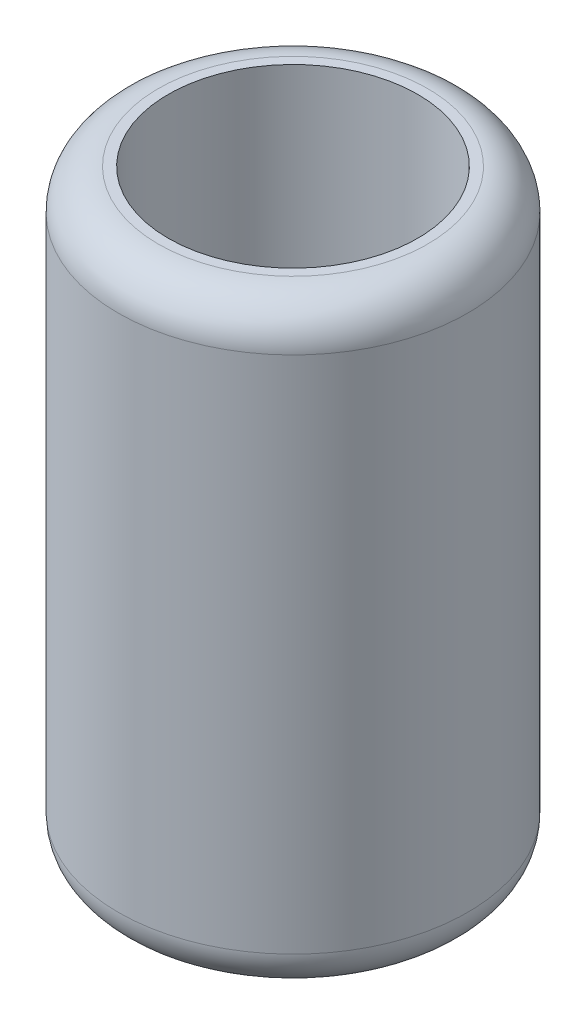
ISO-10303-21;
HEADER;
FILE_DESCRIPTION(('STEP AP214'),'2;1');
FILE_NAME('part.step','',(''),(''),'','','');
FILE_SCHEMA(('AUTOMOTIVE_DESIGN { 1 0 10303 214 1 1 1 1 }'));
ENDSEC;
DATA;
#1=APPLICATION_CONTEXT('core data for automotive mechanical design processes');
#2=APPLICATION_PROTOCOL_DEFINITION('international standard','automotive_design',2000,#1);
#3=PRODUCT_CONTEXT('',#1,'mechanical');
#4=PRODUCT('Part','Part','',(#3));
#5=PRODUCT_RELATED_PRODUCT_CATEGORY('part','',(#4));
#6=PRODUCT_DEFINITION_FORMATION('','',#4);
#7=PRODUCT_DEFINITION_CONTEXT('part definition',#1,'design');
#8=PRODUCT_DEFINITION('design','',#6,#7);
#9=PRODUCT_DEFINITION_SHAPE('','',#8);
#10=(LENGTH_UNIT() NAMED_UNIT(*) SI_UNIT(.MILLI.,.METRE.));
#11=(NAMED_UNIT(*) PLANE_ANGLE_UNIT() SI_UNIT($,.RADIAN.));
#12=(NAMED_UNIT(*) SI_UNIT($,.STERADIAN.) SOLID_ANGLE_UNIT());
#13=UNCERTAINTY_MEASURE_WITH_UNIT(LENGTH_MEASURE(1.E-05),#10,'distance_accuracy_value','');
#14=(GEOMETRIC_REPRESENTATION_CONTEXT(3) GLOBAL_UNCERTAINTY_ASSIGNED_CONTEXT((#13)) GLOBAL_UNIT_ASSIGNED_CONTEXT((#10,
#11,#12)) REPRESENTATION_CONTEXT('',''));
#15=CARTESIAN_POINT('',(0.,0.,0.));
#16=DIRECTION('',(0.,0.,1.));
#17=DIRECTION('',(1.,0.,0.));
#18=AXIS2_PLACEMENT_3D('',#15,#16,#17);
#19=CARTESIAN_POINT('',(0.,38.1,0.));
#20=DIRECTION('',(0.,-1.,0.));
#21=DIRECTION('',(0.,0.,-1.));
#22=AXIS2_PLACEMENT_3D('',#19,#20,#21);
#23=CYLINDRICAL_SURFACE('',#22,11.1125);
#24=CARTESIAN_POINT('',(0.,2.53999999999999,0.));
#25=DIRECTION('',(0.,1.,0.));
#26=DIRECTION('',(0.,0.,1.));
#27=AXIS2_PLACEMENT_3D('',#24,#25,#26);
#28=CIRCLE('',#27,11.1125);
#29=CARTESIAN_POINT('',(0.,2.53999999999999,11.1125));
#30=VERTEX_POINT('',#29);
#31=EDGE_CURVE('E46',#30,#30,#28,.T.);
#32=ORIENTED_EDGE('',*,*,#31,.T.);
#33=EDGE_LOOP('',(#32));
#34=FACE_BOUND('',#33,.T.);
#35=CARTESIAN_POINT('',(0.,35.56,0.));
#36=DIRECTION('',(0.,1.,0.));
#37=DIRECTION('',(0.,0.,1.));
#38=AXIS2_PLACEMENT_3D('',#35,#36,#37);
#39=CIRCLE('',#38,11.1125);
#40=CARTESIAN_POINT('',(0.,35.56,11.1125));
#41=VERTEX_POINT('',#40);
#42=EDGE_CURVE('E50',#41,#41,#39,.F.);
#43=ORIENTED_EDGE('',*,*,#42,.T.);
#44=EDGE_LOOP('',(#43));
#45=FACE_BOUND('',#44,.T.);
#46=ADVANCED_FACE('F35',(#34,#45),#23,.T.);
#47=CARTESIAN_POINT('',(0.,38.1,0.));
#48=DIRECTION('',(0.,1.,0.));
#49=DIRECTION('',(0.,0.,1.));
#50=AXIS2_PLACEMENT_3D('',#47,#48,#49);
#51=PLANE('',#50);
#52=CARTESIAN_POINT('',(0.,38.1,0.));
#53=DIRECTION('',(0.,1.,0.));
#54=DIRECTION('',(0.,0.,1.));
#55=AXIS2_PLACEMENT_3D('',#52,#53,#54);
#56=CIRCLE('',#55,8.5725);
#57=CARTESIAN_POINT('',(0.,38.1,8.5725));
#58=VERTEX_POINT('',#57);
#59=EDGE_CURVE('E10',#58,#58,#56,.T.);
#60=ORIENTED_EDGE('',*,*,#59,.T.);
#61=EDGE_LOOP('',(#60));
#62=FACE_BOUND('',#61,.T.);
#63=CARTESIAN_POINT('',(0.,38.1,0.));
#64=DIRECTION('',(0.,1.,0.));
#65=DIRECTION('',(0.,0.,1.));
#66=AXIS2_PLACEMENT_3D('',#63,#64,#65);
#67=CIRCLE('',#66,7.9375);
#68=CARTESIAN_POINT('',(0.,38.1,7.9375));
#69=VERTEX_POINT('',#68);
#70=EDGE_CURVE('E56',#69,#69,#67,.T.);
#71=ORIENTED_EDGE('',*,*,#70,.F.);
#72=EDGE_LOOP('',(#71));
#73=FACE_BOUND('',#72,.T.);
#74=ADVANCED_FACE('F71',(#62,#73),#51,.T.);
#75=CARTESIAN_POINT('',(0.,0.,0.));
#76=DIRECTION('',(0.,1.,0.));
#77=DIRECTION('',(0.,0.,1.));
#78=AXIS2_PLACEMENT_3D('',#75,#76,#77);
#79=PLANE('',#78);
#80=CARTESIAN_POINT('',(0.,0.,0.));
#81=DIRECTION('',(0.,1.,0.));
#82=DIRECTION('',(0.,0.,1.));
#83=AXIS2_PLACEMENT_3D('',#80,#81,#82);
#84=CIRCLE('',#83,8.5725);
#85=CARTESIAN_POINT('',(0.,0.,8.5725));
#86=VERTEX_POINT('',#85);
#87=EDGE_CURVE('E42',#86,#86,#84,.F.);
#88=ORIENTED_EDGE('',*,*,#87,.T.);
#89=EDGE_LOOP('',(#88));
#90=FACE_BOUND('',#89,.T.);
#91=CARTESIAN_POINT('',(0.,0.,0.));
#92=DIRECTION('',(0.,1.,0.));
#93=DIRECTION('',(0.,0.,1.));
#94=AXIS2_PLACEMENT_3D('',#91,#92,#93);
#95=CIRCLE('',#94,7.9375);
#96=CARTESIAN_POINT('',(0.,0.,7.9375));
#97=VERTEX_POINT('',#96);
#98=EDGE_CURVE('E55',#97,#97,#95,.T.);
#99=ORIENTED_EDGE('',*,*,#98,.T.);
#100=EDGE_LOOP('',(#99));
#101=FACE_BOUND('',#100,.T.);
#102=ADVANCED_FACE('F62',(#90,#101),#79,.F.);
#103=CARTESIAN_POINT('',(0.,0.,0.));
#104=DIRECTION('',(0.,1.,0.));
#105=DIRECTION('',(0.,0.,1.));
#106=AXIS2_PLACEMENT_3D('',#103,#104,#105);
#107=CYLINDRICAL_SURFACE('',#106,7.9375);
#108=ORIENTED_EDGE('',*,*,#98,.F.);
#109=EDGE_LOOP('',(#108));
#110=FACE_BOUND('',#109,.T.);
#111=ORIENTED_EDGE('',*,*,#70,.T.);
#112=EDGE_LOOP('',(#111));
#113=FACE_BOUND('',#112,.T.);
#114=ADVANCED_FACE('F64',(#110,#113),#107,.F.);
#115=CARTESIAN_POINT('',(0.,2.54,0.));
#116=DIRECTION('',(0.,1.,0.));
#117=DIRECTION('',(0.,0.,1.));
#118=AXIS2_PLACEMENT_3D('',#115,#116,#117);
#119=TOROIDAL_SURFACE('',#118,8.5725,2.54);
#120=ORIENTED_EDGE('',*,*,#87,.F.);
#121=EDGE_LOOP('',(#120));
#122=FACE_BOUND('',#121,.T.);
#123=ORIENTED_EDGE('',*,*,#31,.F.);
#124=EDGE_LOOP('',(#123));
#125=FACE_BOUND('',#124,.T.);
#126=ADVANCED_FACE('F67',(#122,#125),#119,.T.);
#127=CARTESIAN_POINT('',(0.,35.56,0.));
#128=DIRECTION('',(0.,1.,0.));
#129=DIRECTION('',(0.,0.,1.));
#130=AXIS2_PLACEMENT_3D('',#127,#128,#129);
#131=TOROIDAL_SURFACE('',#130,8.5725,2.54);
#132=ORIENTED_EDGE('',*,*,#42,.F.);
#133=EDGE_LOOP('',(#132));
#134=FACE_BOUND('',#133,.T.);
#135=ORIENTED_EDGE('',*,*,#59,.F.);
#136=EDGE_LOOP('',(#135));
#137=FACE_BOUND('',#136,.T.);
#138=ADVANCED_FACE('F37',(#134,#137),#131,.T.);
#139=CLOSED_SHELL('',(#46,#74,#102,#114,#126,#138));
#140=MANIFOLD_SOLID_BREP('B2',#139);
#141=ADVANCED_BREP_SHAPE_REPRESENTATION('',(#18,#140),#14);
#142=SHAPE_DEFINITION_REPRESENTATION(#9,#141);
ENDSEC;
END-ISO-10303-21;
